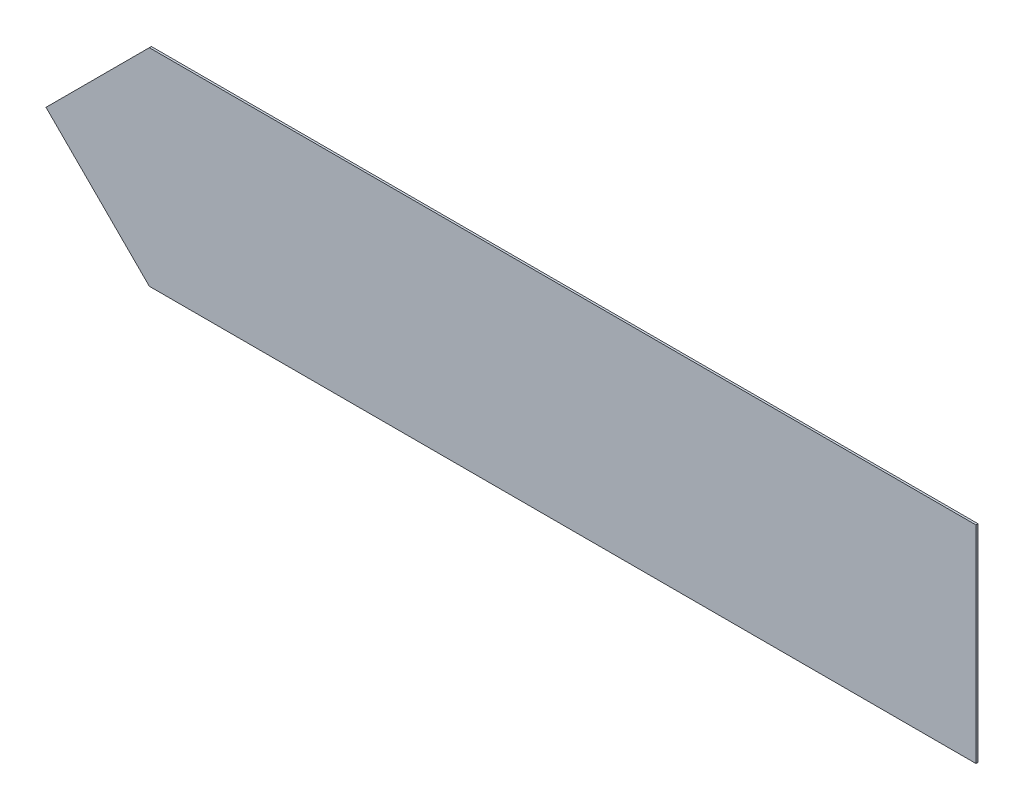
ISO-10303-21;
HEADER;
FILE_DESCRIPTION(('STEP AP214'),'2;1');
FILE_NAME('part.step','',(''),(''),'','','');
FILE_SCHEMA(('AUTOMOTIVE_DESIGN { 1 0 10303 214 1 1 1 1 }'));
ENDSEC;
DATA;
#1=APPLICATION_CONTEXT('core data for automotive mechanical design processes');
#2=APPLICATION_PROTOCOL_DEFINITION('international standard','automotive_design',2000,#1);
#3=PRODUCT_CONTEXT('',#1,'mechanical');
#4=PRODUCT('Part','Part','',(#3));
#5=PRODUCT_RELATED_PRODUCT_CATEGORY('part','',(#4));
#6=PRODUCT_DEFINITION_FORMATION('','',#4);
#7=PRODUCT_DEFINITION_CONTEXT('part definition',#1,'design');
#8=PRODUCT_DEFINITION('design','',#6,#7);
#9=PRODUCT_DEFINITION_SHAPE('','',#8);
#10=(LENGTH_UNIT() NAMED_UNIT(*) SI_UNIT(.MILLI.,.METRE.));
#11=(NAMED_UNIT(*) PLANE_ANGLE_UNIT() SI_UNIT($,.RADIAN.));
#12=(NAMED_UNIT(*) SI_UNIT($,.STERADIAN.) SOLID_ANGLE_UNIT());
#13=UNCERTAINTY_MEASURE_WITH_UNIT(LENGTH_MEASURE(1.E-05),#10,'distance_accuracy_value','');
#14=(GEOMETRIC_REPRESENTATION_CONTEXT(3) GLOBAL_UNCERTAINTY_ASSIGNED_CONTEXT((#13)) GLOBAL_UNIT_ASSIGNED_CONTEXT((#10,
#11,#12)) REPRESENTATION_CONTEXT('',''));
#15=CARTESIAN_POINT('',(0.,0.,0.));
#16=DIRECTION('',(0.,0.,1.));
#17=DIRECTION('',(1.,0.,0.));
#18=AXIS2_PLACEMENT_3D('',#15,#16,#17);
#19=CARTESIAN_POINT('',(0.,0.,0.254));
#20=DIRECTION('',(0.707106781186548,0.707106781186548,0.));
#21=DIRECTION('',(-0.707106781186547,0.707106781186548,0.));
#22=AXIS2_PLACEMENT_3D('',#19,#20,#21);
#23=PLANE('',#22);
#24=DIRECTION('',(0.707106781186547,-0.707106781186548,0.));
#25=VECTOR('',#24,1.);
#26=CARTESIAN_POINT('',(0.,0.,0.));
#27=LINE('',#26,#25);
#28=CARTESIAN_POINT('',(0.,0.,0.));
#29=VERTEX_POINT('',#28);
#30=CARTESIAN_POINT('',(12.7,-12.7,0.));
#31=VERTEX_POINT('',#30);
#32=EDGE_CURVE('E128',#29,#31,#27,.T.);
#33=ORIENTED_EDGE('',*,*,#32,.T.);
#34=DIRECTION('',(0.,0.,-1.));
#35=VECTOR('',#34,1.);
#36=CARTESIAN_POINT('',(12.7,-12.7,0.254));
#37=LINE('',#36,#35);
#38=CARTESIAN_POINT('',(12.7,-12.7,0.254));
#39=VERTEX_POINT('',#38);
#40=EDGE_CURVE('E11',#39,#31,#37,.T.);
#41=ORIENTED_EDGE('',*,*,#40,.F.);
#42=DIRECTION('',(0.707106781186547,-0.707106781186548,0.));
#43=VECTOR('',#42,1.);
#44=CARTESIAN_POINT('',(0.,0.,0.254));
#45=LINE('',#44,#43);
#46=CARTESIAN_POINT('',(0.,0.,0.254));
#47=VERTEX_POINT('',#46);
#48=EDGE_CURVE('E140',#47,#39,#45,.T.);
#49=ORIENTED_EDGE('',*,*,#48,.F.);
#50=DIRECTION('',(0.,0.,-1.));
#51=VECTOR('',#50,1.);
#52=CARTESIAN_POINT('',(0.,0.,0.254));
#53=LINE('',#52,#51);
#54=EDGE_CURVE('E124',#47,#29,#53,.T.);
#55=ORIENTED_EDGE('',*,*,#54,.T.);
#56=EDGE_LOOP('',(#33,#41,#49,#55));
#57=FACE_BOUND('',#56,.T.);
#58=ADVANCED_FACE('F38',(#57),#23,.F.);
#59=CARTESIAN_POINT('',(12.7,-12.7,0.254));
#60=DIRECTION('',(0.,1.,0.));
#61=DIRECTION('',(-1.,0.,0.));
#62=AXIS2_PLACEMENT_3D('',#59,#60,#61);
#63=PLANE('',#62);
#64=DIRECTION('',(1.,0.,0.));
#65=VECTOR('',#64,1.);
#66=CARTESIAN_POINT('',(12.7,-12.7,0.));
#67=LINE('',#66,#65);
#68=CARTESIAN_POINT('',(114.3,-12.7,0.));
#69=VERTEX_POINT('',#68);
#70=EDGE_CURVE('E132',#31,#69,#67,.T.);
#71=ORIENTED_EDGE('',*,*,#70,.T.);
#72=DIRECTION('',(0.,0.,-1.));
#73=VECTOR('',#72,1.);
#74=CARTESIAN_POINT('',(114.3,-12.7,0.254));
#75=LINE('',#74,#73);
#76=CARTESIAN_POINT('',(114.3,-12.7,0.254));
#77=VERTEX_POINT('',#76);
#78=EDGE_CURVE('E47',#77,#69,#75,.T.);
#79=ORIENTED_EDGE('',*,*,#78,.F.);
#80=DIRECTION('',(1.,0.,0.));
#81=VECTOR('',#80,1.);
#82=CARTESIAN_POINT('',(12.7,-12.7,0.254));
#83=LINE('',#82,#81);
#84=EDGE_CURVE('E97',#39,#77,#83,.T.);
#85=ORIENTED_EDGE('',*,*,#84,.F.);
#86=ORIENTED_EDGE('',*,*,#40,.T.);
#87=EDGE_LOOP('',(#71,#79,#85,#86));
#88=FACE_BOUND('',#87,.T.);
#89=ADVANCED_FACE('F162',(#88),#63,.F.);
#90=CARTESIAN_POINT('',(114.3,12.7,0.254));
#91=DIRECTION('',(-1.,0.,0.));
#92=DIRECTION('',(0.,0.,1.));
#93=AXIS2_PLACEMENT_3D('',#90,#91,#92);
#94=PLANE('',#93);
#95=DIRECTION('',(0.,1.,0.));
#96=VECTOR('',#95,1.);
#97=CARTESIAN_POINT('',(114.3,12.7,0.));
#98=LINE('',#97,#96);
#99=CARTESIAN_POINT('',(114.3,12.7,0.));
#100=VERTEX_POINT('',#99);
#101=EDGE_CURVE('E115',#69,#100,#98,.T.);
#102=ORIENTED_EDGE('',*,*,#101,.T.);
#103=DIRECTION('',(0.,0.,-1.));
#104=VECTOR('',#103,1.);
#105=CARTESIAN_POINT('',(114.3,12.7,0.254));
#106=LINE('',#105,#104);
#107=CARTESIAN_POINT('',(114.3,12.7,0.254));
#108=VERTEX_POINT('',#107);
#109=EDGE_CURVE('E112',#108,#100,#106,.T.);
#110=ORIENTED_EDGE('',*,*,#109,.F.);
#111=DIRECTION('',(0.,1.,0.));
#112=VECTOR('',#111,1.);
#113=CARTESIAN_POINT('',(114.3,12.7,0.254));
#114=LINE('',#113,#112);
#115=EDGE_CURVE('E103',#77,#108,#114,.T.);
#116=ORIENTED_EDGE('',*,*,#115,.F.);
#117=ORIENTED_EDGE('',*,*,#78,.T.);
#118=EDGE_LOOP('',(#102,#110,#116,#117));
#119=FACE_BOUND('',#118,.T.);
#120=ADVANCED_FACE('F113',(#119),#94,.F.);
#121=CARTESIAN_POINT('',(12.7,12.7,0.254));
#122=DIRECTION('',(0.,-1.,0.));
#123=DIRECTION('',(1.,0.,0.));
#124=AXIS2_PLACEMENT_3D('',#121,#122,#123);
#125=PLANE('',#124);
#126=DIRECTION('',(-1.,0.,0.));
#127=VECTOR('',#126,1.);
#128=CARTESIAN_POINT('',(12.7,12.7,0.));
#129=LINE('',#128,#127);
#130=CARTESIAN_POINT('',(12.7,12.7,0.));
#131=VERTEX_POINT('',#130);
#132=EDGE_CURVE('E82',#100,#131,#129,.T.);
#133=ORIENTED_EDGE('',*,*,#132,.T.);
#134=DIRECTION('',(0.,0.,-1.));
#135=VECTOR('',#134,1.);
#136=CARTESIAN_POINT('',(12.7,12.7,0.254));
#137=LINE('',#136,#135);
#138=CARTESIAN_POINT('',(12.7,12.7,0.254));
#139=VERTEX_POINT('',#138);
#140=EDGE_CURVE('E117',#139,#131,#137,.T.);
#141=ORIENTED_EDGE('',*,*,#140,.F.);
#142=DIRECTION('',(-1.,0.,0.));
#143=VECTOR('',#142,1.);
#144=CARTESIAN_POINT('',(12.7,12.7,0.254));
#145=LINE('',#144,#143);
#146=EDGE_CURVE('E107',#108,#139,#145,.T.);
#147=ORIENTED_EDGE('',*,*,#146,.F.);
#148=ORIENTED_EDGE('',*,*,#109,.T.);
#149=EDGE_LOOP('',(#133,#141,#147,#148));
#150=FACE_BOUND('',#149,.T.);
#151=ADVANCED_FACE('F119',(#150),#125,.F.);
#152=CARTESIAN_POINT('',(0.,0.,0.254));
#153=DIRECTION('',(0.707106781186548,-0.707106781186548,0.));
#154=DIRECTION('',(0.707106781186547,0.707106781186548,0.));
#155=AXIS2_PLACEMENT_3D('',#152,#153,#154);
#156=PLANE('',#155);
#157=DIRECTION('',(-0.707106781186547,-0.707106781186548,0.));
#158=VECTOR('',#157,1.);
#159=CARTESIAN_POINT('',(0.,0.,0.));
#160=LINE('',#159,#158);
#161=EDGE_CURVE('E88',#131,#29,#160,.T.);
#162=ORIENTED_EDGE('',*,*,#161,.T.);
#163=ORIENTED_EDGE('',*,*,#54,.F.);
#164=DIRECTION('',(-0.707106781186547,-0.707106781186548,0.));
#165=VECTOR('',#164,1.);
#166=CARTESIAN_POINT('',(0.,0.,0.254));
#167=LINE('',#166,#165);
#168=EDGE_CURVE('E58',#139,#47,#167,.T.);
#169=ORIENTED_EDGE('',*,*,#168,.F.);
#170=ORIENTED_EDGE('',*,*,#140,.T.);
#171=EDGE_LOOP('',(#162,#163,#169,#170));
#172=FACE_BOUND('',#171,.T.);
#173=ADVANCED_FACE('F151',(#172),#156,.F.);
#174=CARTESIAN_POINT('',(0.,0.,0.254));
#175=DIRECTION('',(0.,0.,1.));
#176=DIRECTION('',(1.,0.,0.));
#177=AXIS2_PLACEMENT_3D('',#174,#175,#176);
#178=PLANE('',#177);
#179=ORIENTED_EDGE('',*,*,#48,.T.);
#180=ORIENTED_EDGE('',*,*,#84,.T.);
#181=ORIENTED_EDGE('',*,*,#115,.T.);
#182=ORIENTED_EDGE('',*,*,#146,.T.);
#183=ORIENTED_EDGE('',*,*,#168,.T.);
#184=EDGE_LOOP('',(#179,#180,#181,#182,#183));
#185=FACE_BOUND('',#184,.T.);
#186=ADVANCED_FACE('F105',(#185),#178,.T.);
#187=CARTESIAN_POINT('',(0.,0.,0.));
#188=DIRECTION('',(0.,0.,1.));
#189=DIRECTION('',(1.,0.,0.));
#190=AXIS2_PLACEMENT_3D('',#187,#188,#189);
#191=PLANE('',#190);
#192=ORIENTED_EDGE('',*,*,#32,.F.);
#193=ORIENTED_EDGE('',*,*,#161,.F.);
#194=ORIENTED_EDGE('',*,*,#132,.F.);
#195=ORIENTED_EDGE('',*,*,#101,.F.);
#196=ORIENTED_EDGE('',*,*,#70,.F.);
#197=EDGE_LOOP('',(#192,#193,#194,#195,#196));
#198=FACE_BOUND('',#197,.T.);
#199=ADVANCED_FACE('F147',(#198),#191,.F.);
#200=CLOSED_SHELL('',(#58,#89,#120,#151,#173,#186,#199));
#201=MANIFOLD_SOLID_BREP('B2',#200);
#202=ADVANCED_BREP_SHAPE_REPRESENTATION('',(#18,#201),#14);
#203=SHAPE_DEFINITION_REPRESENTATION(#9,#202);
ENDSEC;
END-ISO-10303-21;
